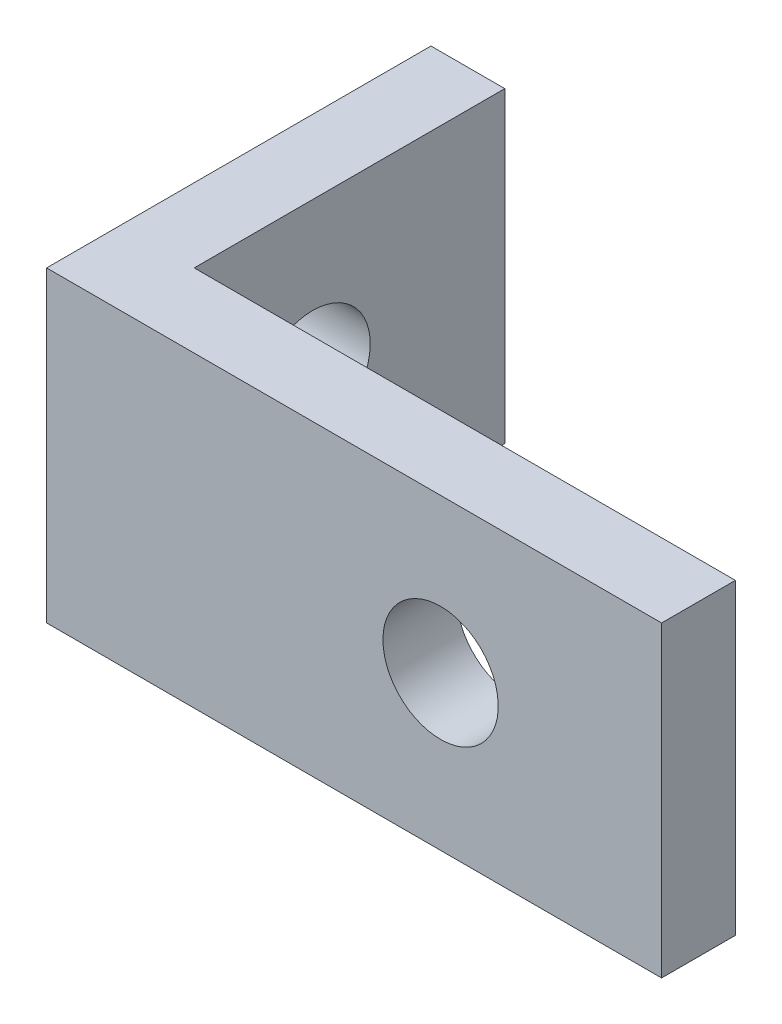
ISO-10303-21;
HEADER;
FILE_DESCRIPTION(('STEP AP214'),'2;1');
FILE_NAME('part.step','',(''),(''),'','','');
FILE_SCHEMA(('AUTOMOTIVE_DESIGN { 1 0 10303 214 1 1 1 1 }'));
ENDSEC;
DATA;
#1=APPLICATION_CONTEXT('core data for automotive mechanical design processes');
#2=APPLICATION_PROTOCOL_DEFINITION('international standard','automotive_design',2000,#1);
#3=PRODUCT_CONTEXT('',#1,'mechanical');
#4=PRODUCT('Part','Part','',(#3));
#5=PRODUCT_RELATED_PRODUCT_CATEGORY('part','',(#4));
#6=PRODUCT_DEFINITION_FORMATION('','',#4);
#7=PRODUCT_DEFINITION_CONTEXT('part definition',#1,'design');
#8=PRODUCT_DEFINITION('design','',#6,#7);
#9=PRODUCT_DEFINITION_SHAPE('','',#8);
#10=(LENGTH_UNIT() NAMED_UNIT(*) SI_UNIT(.MILLI.,.METRE.));
#11=(NAMED_UNIT(*) PLANE_ANGLE_UNIT() SI_UNIT($,.RADIAN.));
#12=(NAMED_UNIT(*) SI_UNIT($,.STERADIAN.) SOLID_ANGLE_UNIT());
#13=UNCERTAINTY_MEASURE_WITH_UNIT(LENGTH_MEASURE(1.E-05),#10,'distance_accuracy_value','');
#14=(GEOMETRIC_REPRESENTATION_CONTEXT(3) GLOBAL_UNCERTAINTY_ASSIGNED_CONTEXT((#13)) GLOBAL_UNIT_ASSIGNED_CONTEXT((#10,
#11,#12)) REPRESENTATION_CONTEXT('',''));
#15=CARTESIAN_POINT('',(0.,0.,0.));
#16=DIRECTION('',(0.,0.,1.));
#17=DIRECTION('',(1.,0.,0.));
#18=AXIS2_PLACEMENT_3D('',#15,#16,#17);
#19=CARTESIAN_POINT('',(0.,0.,3.048));
#20=DIRECTION('',(1.,0.,0.));
#21=DIRECTION('',(0.,0.,-1.));
#22=AXIS2_PLACEMENT_3D('',#19,#20,#21);
#23=PLANE('',#22);
#24=CARTESIAN_POINT('',(0.,6.35,-4.8895));
#25=DIRECTION('',(1.,0.,0.));
#26=DIRECTION('',(0.,1.,0.));
#27=AXIS2_PLACEMENT_3D('',#24,#25,#26);
#28=CIRCLE('',#27,2.38125);
#29=CARTESIAN_POINT('',(0.,8.73125,-4.8895));
#30=VERTEX_POINT('',#29);
#31=EDGE_CURVE('E168',#30,#30,#28,.T.);
#32=ORIENTED_EDGE('',*,*,#31,.T.);
#33=EDGE_LOOP('',(#32));
#34=FACE_BOUND('',#33,.T.);
#35=DIRECTION('',(0.,0.,-1.));
#36=VECTOR('',#35,1.);
#37=CARTESIAN_POINT('',(0.,12.7,3.048));
#38=LINE('',#37,#36);
#39=CARTESIAN_POINT('',(0.,12.7,3.048));
#40=VERTEX_POINT('',#39);
#41=CARTESIAN_POINT('',(0.,12.7,-12.827));
#42=VERTEX_POINT('',#41);
#43=EDGE_CURVE('E110',#40,#42,#38,.T.);
#44=ORIENTED_EDGE('',*,*,#43,.T.);
#45=DIRECTION('',(0.,-1.,0.));
#46=VECTOR('',#45,1.);
#47=CARTESIAN_POINT('',(0.,12.7,-12.827));
#48=LINE('',#47,#46);
#49=CARTESIAN_POINT('',(0.,0.,-12.827));
#50=VERTEX_POINT('',#49);
#51=EDGE_CURVE('E105',#42,#50,#48,.T.);
#52=ORIENTED_EDGE('',*,*,#51,.T.);
#53=DIRECTION('',(0.,0.,-1.));
#54=VECTOR('',#53,1.);
#55=CARTESIAN_POINT('',(0.,0.,3.048));
#56=LINE('',#55,#54);
#57=CARTESIAN_POINT('',(0.,0.,3.048));
#58=VERTEX_POINT('',#57);
#59=EDGE_CURVE('E42',#58,#50,#56,.T.);
#60=ORIENTED_EDGE('',*,*,#59,.F.);
#61=DIRECTION('',(0.,-1.,0.));
#62=VECTOR('',#61,1.);
#63=CARTESIAN_POINT('',(0.,0.,3.048));
#64=LINE('',#63,#62);
#65=EDGE_CURVE('E125',#40,#58,#64,.T.);
#66=ORIENTED_EDGE('',*,*,#65,.F.);
#67=EDGE_LOOP('',(#44,#52,#60,#66));
#68=FACE_BOUND('',#67,.T.);
#69=ADVANCED_FACE('F35',(#34,#68),#23,.F.);
#70=CARTESIAN_POINT('',(0.,0.,3.048));
#71=DIRECTION('',(0.,1.,0.));
#72=DIRECTION('',(0.,0.,1.));
#73=AXIS2_PLACEMENT_3D('',#70,#71,#72);
#74=PLANE('',#73);
#75=DIRECTION('',(0.,0.,-1.));
#76=VECTOR('',#75,1.);
#77=CARTESIAN_POINT('',(25.4,0.,3.048));
#78=LINE('',#77,#76);
#79=CARTESIAN_POINT('',(25.4,0.,3.048));
#80=VERTEX_POINT('',#79);
#81=CARTESIAN_POINT('',(25.4,0.,0.));
#82=VERTEX_POINT('',#81);
#83=EDGE_CURVE('E99',#80,#82,#78,.T.);
#84=ORIENTED_EDGE('',*,*,#83,.F.);
#85=DIRECTION('',(1.,0.,0.));
#86=VECTOR('',#85,1.);
#87=CARTESIAN_POINT('',(0.,0.,3.048));
#88=LINE('',#87,#86);
#89=EDGE_CURVE('E79',#58,#80,#88,.T.);
#90=ORIENTED_EDGE('',*,*,#89,.F.);
#91=ORIENTED_EDGE('',*,*,#59,.T.);
#92=DIRECTION('',(1.,0.,0.));
#93=VECTOR('',#92,1.);
#94=CARTESIAN_POINT('',(0.,0.,-12.827));
#95=LINE('',#94,#93);
#96=CARTESIAN_POINT('',(3.048,0.,-12.827));
#97=VERTEX_POINT('',#96);
#98=EDGE_CURVE('E95',#50,#97,#95,.T.);
#99=ORIENTED_EDGE('',*,*,#98,.T.);
#100=DIRECTION('',(0.,0.,1.));
#101=VECTOR('',#100,1.);
#102=CARTESIAN_POINT('',(3.048,0.,-12.827));
#103=LINE('',#102,#101);
#104=CARTESIAN_POINT('',(3.048,0.,0.));
#105=VERTEX_POINT('',#104);
#106=EDGE_CURVE('E49',#97,#105,#103,.T.);
#107=ORIENTED_EDGE('',*,*,#106,.T.);
#108=DIRECTION('',(1.,0.,0.));
#109=VECTOR('',#108,1.);
#110=CARTESIAN_POINT('',(0.,0.,0.));
#111=LINE('',#110,#109);
#112=EDGE_CURVE('E123',#105,#82,#111,.T.);
#113=ORIENTED_EDGE('',*,*,#112,.T.);
#114=EDGE_LOOP('',(#84,#90,#91,#99,#107,#113));
#115=FACE_BOUND('',#114,.T.);
#116=ADVANCED_FACE('F94',(#115),#74,.F.);
#117=CARTESIAN_POINT('',(25.4,0.,3.048));
#118=DIRECTION('',(-1.,0.,0.));
#119=DIRECTION('',(0.,0.,1.));
#120=AXIS2_PLACEMENT_3D('',#117,#118,#119);
#121=PLANE('',#120);
#122=DIRECTION('',(0.,1.,0.));
#123=VECTOR('',#122,1.);
#124=CARTESIAN_POINT('',(25.4,0.,0.));
#125=LINE('',#124,#123);
#126=CARTESIAN_POINT('',(25.4,12.7,0.));
#127=VERTEX_POINT('',#126);
#128=EDGE_CURVE('E72',#82,#127,#125,.T.);
#129=ORIENTED_EDGE('',*,*,#128,.T.);
#130=DIRECTION('',(0.,0.,-1.));
#131=VECTOR('',#130,1.);
#132=CARTESIAN_POINT('',(25.4,12.7,3.048));
#133=LINE('',#132,#131);
#134=CARTESIAN_POINT('',(25.4,12.7,3.048));
#135=VERTEX_POINT('',#134);
#136=EDGE_CURVE('E137',#135,#127,#133,.T.);
#137=ORIENTED_EDGE('',*,*,#136,.F.);
#138=DIRECTION('',(0.,1.,0.));
#139=VECTOR('',#138,1.);
#140=CARTESIAN_POINT('',(25.4,0.,3.048));
#141=LINE('',#140,#139);
#142=EDGE_CURVE('E129',#80,#135,#141,.T.);
#143=ORIENTED_EDGE('',*,*,#142,.F.);
#144=ORIENTED_EDGE('',*,*,#83,.T.);
#145=EDGE_LOOP('',(#129,#137,#143,#144));
#146=FACE_BOUND('',#145,.T.);
#147=ADVANCED_FACE('F140',(#146),#121,.F.);
#148=CARTESIAN_POINT('',(0.,12.7,3.048));
#149=DIRECTION('',(0.,-1.,0.));
#150=DIRECTION('',(0.,0.,-1.));
#151=AXIS2_PLACEMENT_3D('',#148,#149,#150);
#152=PLANE('',#151);
#153=DIRECTION('',(-1.,0.,0.));
#154=VECTOR('',#153,1.);
#155=CARTESIAN_POINT('',(0.,12.7,0.));
#156=LINE('',#155,#154);
#157=CARTESIAN_POINT('',(3.048,12.7,0.));
#158=VERTEX_POINT('',#157);
#159=EDGE_CURVE('E127',#127,#158,#156,.T.);
#160=ORIENTED_EDGE('',*,*,#159,.T.);
#161=DIRECTION('',(0.,0.,1.));
#162=VECTOR('',#161,1.);
#163=CARTESIAN_POINT('',(3.048,12.7,-12.827));
#164=LINE('',#163,#162);
#165=CARTESIAN_POINT('',(3.048,12.7,-12.827));
#166=VERTEX_POINT('',#165);
#167=EDGE_CURVE('E121',#166,#158,#164,.T.);
#168=ORIENTED_EDGE('',*,*,#167,.F.);
#169=DIRECTION('',(-1.,0.,0.));
#170=VECTOR('',#169,1.);
#171=CARTESIAN_POINT('',(0.,12.7,-12.827));
#172=LINE('',#171,#170);
#173=EDGE_CURVE('E119',#166,#42,#172,.T.);
#174=ORIENTED_EDGE('',*,*,#173,.T.);
#175=ORIENTED_EDGE('',*,*,#43,.F.);
#176=DIRECTION('',(-1.,0.,0.));
#177=VECTOR('',#176,1.);
#178=CARTESIAN_POINT('',(0.,12.7,3.048));
#179=LINE('',#178,#177);
#180=EDGE_CURVE('E57',#135,#40,#179,.T.);
#181=ORIENTED_EDGE('',*,*,#180,.F.);
#182=ORIENTED_EDGE('',*,*,#136,.T.);
#183=EDGE_LOOP('',(#160,#168,#174,#175,#181,#182));
#184=FACE_BOUND('',#183,.T.);
#185=ADVANCED_FACE('F147',(#184),#152,.F.);
#186=CARTESIAN_POINT('',(0.,0.,3.048));
#187=DIRECTION('',(0.,0.,-1.));
#188=DIRECTION('',(-1.,0.,0.));
#189=AXIS2_PLACEMENT_3D('',#186,#187,#188);
#190=PLANE('',#189);
#191=CARTESIAN_POINT('',(16.271875,6.35,3.048));
#192=DIRECTION('',(0.,0.,-1.));
#193=DIRECTION('',(-1.,0.,0.));
#194=AXIS2_PLACEMENT_3D('',#191,#192,#193);
#195=CIRCLE('',#194,2.38125);
#196=CARTESIAN_POINT('',(13.890625,6.35,3.048));
#197=VERTEX_POINT('',#196);
#198=EDGE_CURVE('E111',#197,#197,#195,.T.);
#199=ORIENTED_EDGE('',*,*,#198,.T.);
#200=EDGE_LOOP('',(#199));
#201=FACE_BOUND('',#200,.T.);
#202=ORIENTED_EDGE('',*,*,#180,.T.);
#203=ORIENTED_EDGE('',*,*,#65,.T.);
#204=ORIENTED_EDGE('',*,*,#89,.T.);
#205=ORIENTED_EDGE('',*,*,#142,.T.);
#206=EDGE_LOOP('',(#202,#203,#204,#205));
#207=FACE_BOUND('',#206,.T.);
#208=ADVANCED_FACE('F148',(#201,#207),#190,.F.);
#209=CARTESIAN_POINT('',(0.,0.,0.));
#210=DIRECTION('',(0.,0.,-1.));
#211=DIRECTION('',(-1.,0.,0.));
#212=AXIS2_PLACEMENT_3D('',#209,#210,#211);
#213=PLANE('',#212);
#214=CARTESIAN_POINT('',(16.271875,6.35,0.));
#215=DIRECTION('',(0.,0.,-1.));
#216=DIRECTION('',(-1.,0.,0.));
#217=AXIS2_PLACEMENT_3D('',#214,#215,#216);
#218=CIRCLE('',#217,2.38125);
#219=CARTESIAN_POINT('',(13.890625,6.35,0.));
#220=VERTEX_POINT('',#219);
#221=EDGE_CURVE('E114',#220,#220,#218,.T.);
#222=ORIENTED_EDGE('',*,*,#221,.F.);
#223=EDGE_LOOP('',(#222));
#224=FACE_BOUND('',#223,.T.);
#225=DIRECTION('',(0.,-1.,0.));
#226=VECTOR('',#225,1.);
#227=CARTESIAN_POINT('',(3.048,0.,0.));
#228=LINE('',#227,#226);
#229=EDGE_CURVE('E11',#158,#105,#228,.T.);
#230=ORIENTED_EDGE('',*,*,#229,.F.);
#231=ORIENTED_EDGE('',*,*,#159,.F.);
#232=ORIENTED_EDGE('',*,*,#128,.F.);
#233=ORIENTED_EDGE('',*,*,#112,.F.);
#234=EDGE_LOOP('',(#230,#231,#232,#233));
#235=FACE_BOUND('',#234,.T.);
#236=ADVANCED_FACE('F145',(#224,#235),#213,.T.);
#237=CARTESIAN_POINT('',(3.048,12.7,-12.827));
#238=DIRECTION('',(1.,0.,0.));
#239=DIRECTION('',(0.,1.,0.));
#240=AXIS2_PLACEMENT_3D('',#237,#238,#239);
#241=PLANE('',#240);
#242=CARTESIAN_POINT('',(3.048,6.35,-4.8895));
#243=DIRECTION('',(1.,0.,0.));
#244=DIRECTION('',(0.,1.,0.));
#245=AXIS2_PLACEMENT_3D('',#242,#243,#244);
#246=CIRCLE('',#245,2.38125);
#247=CARTESIAN_POINT('',(3.048,8.73125,-4.8895));
#248=VERTEX_POINT('',#247);
#249=EDGE_CURVE('E170',#248,#248,#246,.T.);
#250=ORIENTED_EDGE('',*,*,#249,.F.);
#251=EDGE_LOOP('',(#250));
#252=FACE_BOUND('',#251,.T.);
#253=ORIENTED_EDGE('',*,*,#167,.T.);
#254=ORIENTED_EDGE('',*,*,#229,.T.);
#255=ORIENTED_EDGE('',*,*,#106,.F.);
#256=DIRECTION('',(0.,1.,0.));
#257=VECTOR('',#256,1.);
#258=CARTESIAN_POINT('',(3.048,12.7,-12.827));
#259=LINE('',#258,#257);
#260=EDGE_CURVE('E108',#97,#166,#259,.T.);
#261=ORIENTED_EDGE('',*,*,#260,.T.);
#262=EDGE_LOOP('',(#253,#254,#255,#261));
#263=FACE_BOUND('',#262,.T.);
#264=ADVANCED_FACE('F156',(#252,#263),#241,.T.);
#265=CARTESIAN_POINT('',(0.,0.,-12.827));
#266=DIRECTION('',(0.,0.,1.));
#267=DIRECTION('',(1.,0.,0.));
#268=AXIS2_PLACEMENT_3D('',#265,#266,#267);
#269=PLANE('',#268);
#270=ORIENTED_EDGE('',*,*,#51,.F.);
#271=ORIENTED_EDGE('',*,*,#173,.F.);
#272=ORIENTED_EDGE('',*,*,#260,.F.);
#273=ORIENTED_EDGE('',*,*,#98,.F.);
#274=EDGE_LOOP('',(#270,#271,#272,#273));
#275=FACE_BOUND('',#274,.T.);
#276=ADVANCED_FACE('F103',(#275),#269,.F.);
#277=CARTESIAN_POINT('',(16.271875,6.35,3.048));
#278=DIRECTION('',(0.,0.,-1.));
#279=DIRECTION('',(-1.,0.,0.));
#280=AXIS2_PLACEMENT_3D('',#277,#278,#279);
#281=CYLINDRICAL_SURFACE('',#280,2.38125);
#282=ORIENTED_EDGE('',*,*,#198,.F.);
#283=EDGE_LOOP('',(#282));
#284=FACE_BOUND('',#283,.T.);
#285=ORIENTED_EDGE('',*,*,#221,.T.);
#286=EDGE_LOOP('',(#285));
#287=FACE_BOUND('',#286,.T.);
#288=ADVANCED_FACE('F184',(#284,#287),#281,.F.);
#289=CARTESIAN_POINT('',(0.,6.35,-4.8895));
#290=DIRECTION('',(1.,0.,0.));
#291=DIRECTION('',(0.,1.,0.));
#292=AXIS2_PLACEMENT_3D('',#289,#290,#291);
#293=CYLINDRICAL_SURFACE('',#292,2.38125);
#294=ORIENTED_EDGE('',*,*,#31,.F.);
#295=EDGE_LOOP('',(#294));
#296=FACE_BOUND('',#295,.T.);
#297=ORIENTED_EDGE('',*,*,#249,.T.);
#298=EDGE_LOOP('',(#297));
#299=FACE_BOUND('',#298,.T.);
#300=ADVANCED_FACE('F177',(#296,#299),#293,.F.);
#301=CLOSED_SHELL('',(#69,#116,#147,#185,#208,#236,#264,#276,#288,#300));
#302=MANIFOLD_SOLID_BREP('B2',#301);
#303=ADVANCED_BREP_SHAPE_REPRESENTATION('',(#18,#302),#14);
#304=SHAPE_DEFINITION_REPRESENTATION(#9,#303);
ENDSEC;
END-ISO-10303-21;
